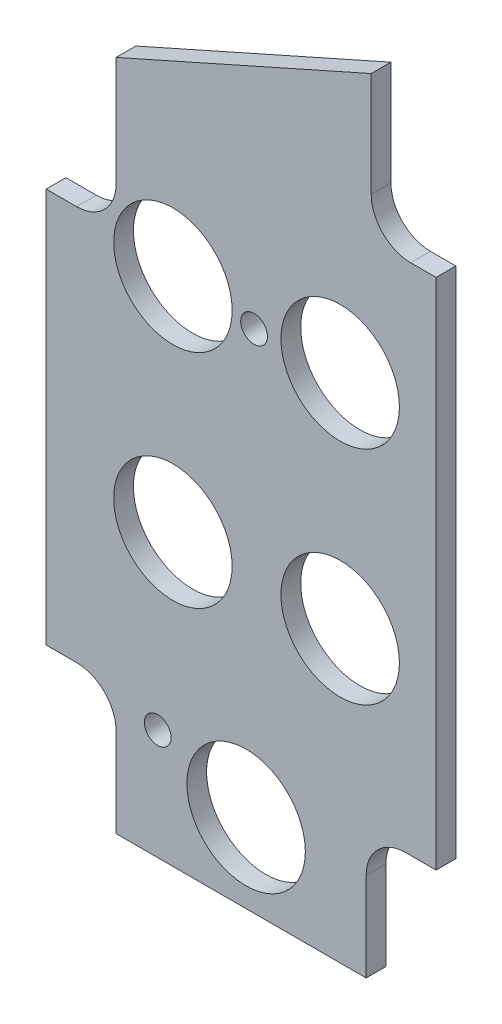
ISO-10303-21;
HEADER;
FILE_DESCRIPTION(('STEP AP214'),'2;1');
FILE_NAME('part.step','',(''),(''),'','','');
FILE_SCHEMA(('AUTOMOTIVE_DESIGN { 1 0 10303 214 1 1 1 1 }'));
ENDSEC;
DATA;
#1=APPLICATION_CONTEXT('core data for automotive mechanical design processes');
#2=APPLICATION_PROTOCOL_DEFINITION('international standard','automotive_design',2000,#1);
#3=PRODUCT_CONTEXT('',#1,'mechanical');
#4=PRODUCT('Part','Part','',(#3));
#5=PRODUCT_RELATED_PRODUCT_CATEGORY('part','',(#4));
#6=PRODUCT_DEFINITION_FORMATION('','',#4);
#7=PRODUCT_DEFINITION_CONTEXT('part definition',#1,'design');
#8=PRODUCT_DEFINITION('design','',#6,#7);
#9=PRODUCT_DEFINITION_SHAPE('','',#8);
#10=(LENGTH_UNIT() NAMED_UNIT(*) SI_UNIT(.MILLI.,.METRE.));
#11=(NAMED_UNIT(*) PLANE_ANGLE_UNIT() SI_UNIT($,.RADIAN.));
#12=(NAMED_UNIT(*) SI_UNIT($,.STERADIAN.) SOLID_ANGLE_UNIT());
#13=UNCERTAINTY_MEASURE_WITH_UNIT(LENGTH_MEASURE(1.E-05),#10,'distance_accuracy_value','');
#14=(GEOMETRIC_REPRESENTATION_CONTEXT(3) GLOBAL_UNCERTAINTY_ASSIGNED_CONTEXT((#13)) GLOBAL_UNIT_ASSIGNED_CONTEXT((#10,
#11,#12)) REPRESENTATION_CONTEXT('',''));
#15=CARTESIAN_POINT('',(0.,0.,0.));
#16=DIRECTION('',(0.,0.,1.));
#17=DIRECTION('',(1.,0.,0.));
#18=AXIS2_PLACEMENT_3D('',#15,#16,#17);
#19=CARTESIAN_POINT('',(62.6887935856796,131.,-3.175));
#20=DIRECTION('',(-0.406714772664201,0.913555194663523,0.));
#21=DIRECTION('',(-0.913555194663523,-0.406714772664201,0.));
#22=AXIS2_PLACEMENT_3D('',#19,#20,#21);
#23=PLANE('',#22);
#24=DIRECTION('',(0.,0.,1.));
#25=VECTOR('',#24,1.);
#26=CARTESIAN_POINT('',(11.2395,108.094774495655,-3.175));
#27=LINE('',#26,#25);
#28=CARTESIAN_POINT('',(11.2395,108.094774495655,-3.175));
#29=VERTEX_POINT('',#28);
#30=CARTESIAN_POINT('',(11.2395,108.094774495655,0.));
#31=VERTEX_POINT('',#30);
#32=EDGE_CURVE('E244',#29,#31,#27,.T.);
#33=ORIENTED_EDGE('',*,*,#32,.T.);
#34=DIRECTION('',(-0.913555194663523,-0.406714772664201,0.));
#35=VECTOR('',#34,1.);
#36=CARTESIAN_POINT('',(62.6887935856796,131.,0.));
#37=LINE('',#36,#35);
#38=CARTESIAN_POINT('',(52.2605,126.357323695655,0.));
#39=VERTEX_POINT('',#38);
#40=EDGE_CURVE('E173',#39,#31,#37,.T.);
#41=ORIENTED_EDGE('',*,*,#40,.F.);
#42=DIRECTION('',(0.,0.,1.));
#43=VECTOR('',#42,1.);
#44=CARTESIAN_POINT('',(52.2605,126.357323695655,-3.175));
#45=LINE('',#44,#43);
#46=CARTESIAN_POINT('',(52.2605,126.357323695655,-3.175));
#47=VERTEX_POINT('',#46);
#48=EDGE_CURVE('E157',#47,#39,#45,.T.);
#49=ORIENTED_EDGE('',*,*,#48,.F.);
#50=DIRECTION('',(-0.913555194663523,-0.406714772664201,0.));
#51=VECTOR('',#50,1.);
#52=CARTESIAN_POINT('',(62.6887935856796,131.,-3.175));
#53=LINE('',#52,#51);
#54=EDGE_CURVE('E171',#47,#29,#53,.T.);
#55=ORIENTED_EDGE('',*,*,#54,.T.);
#56=EDGE_LOOP('',(#33,#41,#49,#55));
#57=FACE_BOUND('',#56,.T.);
#58=ADVANCED_FACE('F39',(#57),#23,.T.);
#59=CARTESIAN_POINT('',(62.6887935856796,0.,-3.175));
#60=DIRECTION('',(1.,0.,0.));
#61=DIRECTION('',(0.,0.,-1.));
#62=AXIS2_PLACEMENT_3D('',#59,#60,#61);
#63=PLANE('',#62);
#64=DIRECTION('',(0.,0.,1.));
#65=VECTOR('',#64,1.);
#66=CARTESIAN_POINT('',(62.6887935856796,20.64,-3.175));
#67=LINE('',#66,#65);
#68=CARTESIAN_POINT('',(62.6887935856796,20.64,-3.175));
#69=VERTEX_POINT('',#68);
#70=CARTESIAN_POINT('',(62.6887935856796,20.64,0.));
#71=VERTEX_POINT('',#70);
#72=EDGE_CURVE('E251',#69,#71,#67,.T.);
#73=ORIENTED_EDGE('',*,*,#72,.F.);
#74=DIRECTION('',(0.,1.,0.));
#75=VECTOR('',#74,1.);
#76=CARTESIAN_POINT('',(62.6887935856796,0.,-3.175));
#77=LINE('',#76,#75);
#78=CARTESIAN_POINT('',(62.6887935856796,103.1875,-3.175));
#79=VERTEX_POINT('',#78);
#80=EDGE_CURVE('E11',#69,#79,#77,.T.);
#81=ORIENTED_EDGE('',*,*,#80,.T.);
#82=DIRECTION('',(0.,0.,1.));
#83=VECTOR('',#82,1.);
#84=CARTESIAN_POINT('',(62.6887935856796,103.1875,-3.175));
#85=LINE('',#84,#83);
#86=CARTESIAN_POINT('',(62.6887935856796,103.1875,0.));
#87=VERTEX_POINT('',#86);
#88=EDGE_CURVE('E224',#79,#87,#85,.T.);
#89=ORIENTED_EDGE('',*,*,#88,.T.);
#90=DIRECTION('',(0.,1.,0.));
#91=VECTOR('',#90,1.);
#92=CARTESIAN_POINT('',(62.6887935856796,0.,0.));
#93=LINE('',#92,#91);
#94=EDGE_CURVE('E183',#71,#87,#93,.T.);
#95=ORIENTED_EDGE('',*,*,#94,.F.);
#96=EDGE_LOOP('',(#73,#81,#89,#95));
#97=FACE_BOUND('',#96,.T.);
#98=ADVANCED_FACE('F349',(#97),#63,.T.);
#99=CARTESIAN_POINT('',(0.,0.,-3.175));
#100=DIRECTION('',(0.,-1.,0.));
#101=DIRECTION('',(0.,0.,-1.));
#102=AXIS2_PLACEMENT_3D('',#99,#100,#101);
#103=PLANE('',#102);
#104=DIRECTION('',(0.,0.,1.));
#105=VECTOR('',#104,1.);
#106=CARTESIAN_POINT('',(51.4487935856797,0.,-3.175));
#107=LINE('',#106,#105);
#108=CARTESIAN_POINT('',(51.4487935856797,0.,-3.175));
#109=VERTEX_POINT('',#108);
#110=CARTESIAN_POINT('',(51.4487935856797,0.,0.));
#111=VERTEX_POINT('',#110);
#112=EDGE_CURVE('E253',#109,#111,#107,.T.);
#113=ORIENTED_EDGE('',*,*,#112,.T.);
#114=DIRECTION('',(1.,0.,0.));
#115=VECTOR('',#114,1.);
#116=CARTESIAN_POINT('',(0.,0.,0.));
#117=LINE('',#116,#115);
#118=CARTESIAN_POINT('',(11.24,0.,0.));
#119=VERTEX_POINT('',#118);
#120=EDGE_CURVE('E188',#119,#111,#117,.T.);
#121=ORIENTED_EDGE('',*,*,#120,.F.);
#122=DIRECTION('',(0.,0.,1.));
#123=VECTOR('',#122,1.);
#124=CARTESIAN_POINT('',(11.24,0.,-3.175));
#125=LINE('',#124,#123);
#126=CARTESIAN_POINT('',(11.24,0.,-3.175));
#127=VERTEX_POINT('',#126);
#128=EDGE_CURVE('E63',#127,#119,#125,.T.);
#129=ORIENTED_EDGE('',*,*,#128,.F.);
#130=DIRECTION('',(1.,0.,0.));
#131=VECTOR('',#130,1.);
#132=CARTESIAN_POINT('',(0.,0.,-3.175));
#133=LINE('',#132,#131);
#134=EDGE_CURVE('E47',#127,#109,#133,.T.);
#135=ORIENTED_EDGE('',*,*,#134,.T.);
#136=EDGE_LOOP('',(#113,#121,#129,#135));
#137=FACE_BOUND('',#136,.T.);
#138=ADVANCED_FACE('F353',(#137),#103,.T.);
#139=CARTESIAN_POINT('',(0.,103.090949095655,-3.175));
#140=DIRECTION('',(-1.,0.,0.));
#141=DIRECTION('',(0.,-1.,0.));
#142=AXIS2_PLACEMENT_3D('',#139,#140,#141);
#143=PLANE('',#142);
#144=DIRECTION('',(0.,0.,1.));
#145=VECTOR('',#144,1.);
#146=CARTESIAN_POINT('',(0.,84.1375,-3.175));
#147=LINE('',#146,#145);
#148=CARTESIAN_POINT('',(0.,84.1375,-3.175));
#149=VERTEX_POINT('',#148);
#150=CARTESIAN_POINT('',(0.,84.1375,0.));
#151=VERTEX_POINT('',#150);
#152=EDGE_CURVE('E264',#149,#151,#147,.T.);
#153=ORIENTED_EDGE('',*,*,#152,.F.);
#154=DIRECTION('',(0.,-1.,0.));
#155=VECTOR('',#154,1.);
#156=CARTESIAN_POINT('',(0.,103.090949095655,-3.175));
#157=LINE('',#156,#155);
#158=CARTESIAN_POINT('',(0.,20.64,-3.175));
#159=VERTEX_POINT('',#158);
#160=EDGE_CURVE('E182',#149,#159,#157,.T.);
#161=ORIENTED_EDGE('',*,*,#160,.T.);
#162=DIRECTION('',(0.,0.,1.));
#163=VECTOR('',#162,1.);
#164=CARTESIAN_POINT('',(0.,20.64,-3.175));
#165=LINE('',#164,#163);
#166=CARTESIAN_POINT('',(0.,20.64,0.));
#167=VERTEX_POINT('',#166);
#168=EDGE_CURVE('E292',#159,#167,#165,.T.);
#169=ORIENTED_EDGE('',*,*,#168,.T.);
#170=DIRECTION('',(0.,-1.,0.));
#171=VECTOR('',#170,1.);
#172=CARTESIAN_POINT('',(0.,103.090949095655,0.));
#173=LINE('',#172,#171);
#174=EDGE_CURVE('E197',#151,#167,#173,.T.);
#175=ORIENTED_EDGE('',*,*,#174,.F.);
#176=EDGE_LOOP('',(#153,#161,#169,#175));
#177=FACE_BOUND('',#176,.T.);
#178=ADVANCED_FACE('F342',(#177),#143,.T.);
#179=CARTESIAN_POINT('',(0.,0.,-3.175));
#180=DIRECTION('',(0.,0.,1.));
#181=DIRECTION('',(1.,0.,0.));
#182=AXIS2_PLACEMENT_3D('',#179,#180,#181);
#183=PLANE('',#182);
#184=CARTESIAN_POINT('',(33.4263356539699,81.3833913233975,-3.175));
#185=DIRECTION('',(0.,0.,1.));
#186=DIRECTION('',(1.,0.,0.));
#187=AXIS2_PLACEMENT_3D('',#184,#185,#186);
#188=CIRCLE('',#187,2.15264999999999);
#189=CARTESIAN_POINT('',(35.5789856539699,81.3833913233975,-3.175));
#190=VERTEX_POINT('',#189);
#191=EDGE_CURVE('E215',#190,#190,#188,.T.);
#192=ORIENTED_EDGE('',*,*,#191,.T.);
#193=EDGE_LOOP('',(#192));
#194=FACE_BOUND('',#193,.T.);
#195=CARTESIAN_POINT('',(17.9313083732309,17.7712279582032,-3.175));
#196=DIRECTION('',(0.,0.,1.));
#197=DIRECTION('',(1.,0.,0.));
#198=AXIS2_PLACEMENT_3D('',#195,#196,#197);
#199=CIRCLE('',#198,2.15265);
#200=CARTESIAN_POINT('',(20.0839583732309,17.7712279582032,-3.175));
#201=VERTEX_POINT('',#200);
#202=EDGE_CURVE('E205',#201,#201,#199,.T.);
#203=ORIENTED_EDGE('',*,*,#202,.T.);
#204=EDGE_LOOP('',(#203));
#205=FACE_BOUND('',#204,.T.);
#206=CARTESIAN_POINT('',(20.3732350591324,46.5480061512906,-3.175));
#207=DIRECTION('',(0.,0.,1.));
#208=DIRECTION('',(1.,0.,0.));
#209=AXIS2_PLACEMENT_3D('',#206,#207,#208);
#210=CIRCLE('',#209,9.525);
#211=CARTESIAN_POINT('',(29.8982350591324,46.5480061512906,-3.175));
#212=VERTEX_POINT('',#211);
#213=EDGE_CURVE('E301',#212,#212,#210,.T.);
#214=ORIENTED_EDGE('',*,*,#213,.T.);
#215=EDGE_LOOP('',(#214));
#216=FACE_BOUND('',#215,.T.);
#217=CARTESIAN_POINT('',(20.3732350591324,82.1854238503903,-3.175));
#218=DIRECTION('',(0.,0.,1.));
#219=DIRECTION('',(1.,0.,0.));
#220=AXIS2_PLACEMENT_3D('',#217,#218,#219);
#221=CIRCLE('',#220,9.52500000000001);
#222=CARTESIAN_POINT('',(29.8982350591324,82.1854238503903,-3.175));
#223=VERTEX_POINT('',#222);
#224=EDGE_CURVE('E307',#223,#223,#221,.T.);
#225=ORIENTED_EDGE('',*,*,#224,.T.);
#226=EDGE_LOOP('',(#225));
#227=FACE_BOUND('',#226,.T.);
#228=CARTESIAN_POINT('',(47.2704904270103,82.1854238503903,-3.175));
#229=DIRECTION('',(0.,0.,1.));
#230=DIRECTION('',(1.,0.,0.));
#231=AXIS2_PLACEMENT_3D('',#228,#229,#230);
#232=CIRCLE('',#231,9.525);
#233=CARTESIAN_POINT('',(56.7954904270103,82.1854238503903,-3.175));
#234=VERTEX_POINT('',#233);
#235=EDGE_CURVE('E313',#234,#234,#232,.T.);
#236=ORIENTED_EDGE('',*,*,#235,.T.);
#237=EDGE_LOOP('',(#236));
#238=FACE_BOUND('',#237,.T.);
#239=CARTESIAN_POINT('',(47.2704904270103,46.5480061512906,-3.175));
#240=DIRECTION('',(0.,0.,1.));
#241=DIRECTION('',(1.,0.,0.));
#242=AXIS2_PLACEMENT_3D('',#239,#240,#241);
#243=CIRCLE('',#242,9.525);
#244=CARTESIAN_POINT('',(56.7954904270103,46.5480061512906,-3.175));
#245=VERTEX_POINT('',#244);
#246=EDGE_CURVE('E319',#245,#245,#243,.T.);
#247=ORIENTED_EDGE('',*,*,#246,.T.);
#248=EDGE_LOOP('',(#247));
#249=FACE_BOUND('',#248,.T.);
#250=CARTESIAN_POINT('',(32.1439076412773,12.7,-3.175));
#251=DIRECTION('',(0.,0.,1.));
#252=DIRECTION('',(1.,0.,0.));
#253=AXIS2_PLACEMENT_3D('',#250,#251,#252);
#254=CIRCLE('',#253,9.525);
#255=CARTESIAN_POINT('',(41.6689076412773,12.7,-3.175));
#256=VERTEX_POINT('',#255);
#257=EDGE_CURVE('E198',#256,#256,#254,.T.);
#258=ORIENTED_EDGE('',*,*,#257,.T.);
#259=EDGE_LOOP('',(#258));
#260=FACE_BOUND('',#259,.T.);
#261=ORIENTED_EDGE('',*,*,#80,.F.);
#262=DIRECTION('',(-1.,0.,0.));
#263=VECTOR('',#262,1.);
#264=CARTESIAN_POINT('',(62.6887935856796,20.64,-3.175));
#265=LINE('',#264,#263);
#266=CARTESIAN_POINT('',(57.7987935856796,20.64,-3.175));
#267=VERTEX_POINT('',#266);
#268=EDGE_CURVE('E238',#69,#267,#265,.T.);
#269=ORIENTED_EDGE('',*,*,#268,.T.);
#270=CARTESIAN_POINT('',(57.7987935856796,14.29,-3.175));
#271=DIRECTION('',(0.,0.,1.));
#272=DIRECTION('',(1.,0.,0.));
#273=AXIS2_PLACEMENT_3D('',#270,#271,#272);
#274=CIRCLE('',#273,6.35);
#275=CARTESIAN_POINT('',(51.4487935856797,14.29,-3.175));
#276=VERTEX_POINT('',#275);
#277=EDGE_CURVE('E231',#267,#276,#274,.T.);
#278=ORIENTED_EDGE('',*,*,#277,.T.);
#279=DIRECTION('',(0.,-1.,0.));
#280=VECTOR('',#279,1.);
#281=CARTESIAN_POINT('',(51.4487935856797,14.29,-3.175));
#282=LINE('',#281,#280);
#283=EDGE_CURVE('E234',#276,#109,#282,.T.);
#284=ORIENTED_EDGE('',*,*,#283,.T.);
#285=ORIENTED_EDGE('',*,*,#134,.F.);
#286=DIRECTION('',(0.,1.,0.));
#287=VECTOR('',#286,1.);
#288=CARTESIAN_POINT('',(11.24,14.29,-3.175));
#289=LINE('',#288,#287);
#290=CARTESIAN_POINT('',(11.24,14.29,-3.175));
#291=VERTEX_POINT('',#290);
#292=EDGE_CURVE('E277',#127,#291,#289,.T.);
#293=ORIENTED_EDGE('',*,*,#292,.T.);
#294=CARTESIAN_POINT('',(4.89,14.29,-3.175));
#295=DIRECTION('',(0.,0.,1.));
#296=DIRECTION('',(-1.,0.,0.));
#297=AXIS2_PLACEMENT_3D('',#294,#295,#296);
#298=CIRCLE('',#297,6.35);
#299=CARTESIAN_POINT('',(4.88999999999996,20.64,-3.175));
#300=VERTEX_POINT('',#299);
#301=EDGE_CURVE('E280',#291,#300,#298,.T.);
#302=ORIENTED_EDGE('',*,*,#301,.T.);
#303=DIRECTION('',(-1.,0.,0.));
#304=VECTOR('',#303,1.);
#305=CARTESIAN_POINT('',(0.,20.64,-3.175));
#306=LINE('',#305,#304);
#307=EDGE_CURVE('E284',#300,#159,#306,.T.);
#308=ORIENTED_EDGE('',*,*,#307,.T.);
#309=ORIENTED_EDGE('',*,*,#160,.F.);
#310=DIRECTION('',(1.,0.,0.));
#311=VECTOR('',#310,1.);
#312=CARTESIAN_POINT('',(0.,84.1375,-3.175));
#313=LINE('',#312,#311);
#314=CARTESIAN_POINT('',(4.8895,84.1375,-3.175));
#315=VERTEX_POINT('',#314);
#316=EDGE_CURVE('E257',#149,#315,#313,.T.);
#317=ORIENTED_EDGE('',*,*,#316,.T.);
#318=CARTESIAN_POINT('',(4.8895,90.4875,-3.175));
#319=DIRECTION('',(0.,0.,1.));
#320=DIRECTION('',(1.,0.,0.));
#321=AXIS2_PLACEMENT_3D('',#318,#319,#320);
#322=CIRCLE('',#321,6.35);
#323=CARTESIAN_POINT('',(11.2395,90.4875,-3.175));
#324=VERTEX_POINT('',#323);
#325=EDGE_CURVE('E260',#315,#324,#322,.T.);
#326=ORIENTED_EDGE('',*,*,#325,.T.);
#327=DIRECTION('',(0.,1.,0.));
#328=VECTOR('',#327,1.);
#329=CARTESIAN_POINT('',(11.2395,90.4875,-3.175));
#330=LINE('',#329,#328);
#331=EDGE_CURVE('E181',#324,#29,#330,.T.);
#332=ORIENTED_EDGE('',*,*,#331,.T.);
#333=ORIENTED_EDGE('',*,*,#54,.F.);
#334=DIRECTION('',(0.,-1.,0.));
#335=VECTOR('',#334,1.);
#336=CARTESIAN_POINT('',(52.2605,109.5375,-3.175));
#337=LINE('',#336,#335);
#338=CARTESIAN_POINT('',(52.2605,109.5375,-3.175));
#339=VERTEX_POINT('',#338);
#340=EDGE_CURVE('E153',#47,#339,#337,.T.);
#341=ORIENTED_EDGE('',*,*,#340,.T.);
#342=CARTESIAN_POINT('',(58.6105,109.5375,-3.175));
#343=DIRECTION('',(0.,0.,1.));
#344=DIRECTION('',(-1.,0.,0.));
#345=AXIS2_PLACEMENT_3D('',#342,#343,#344);
#346=CIRCLE('',#345,6.35);
#347=CARTESIAN_POINT('',(58.6105,103.1875,-3.175));
#348=VERTEX_POINT('',#347);
#349=EDGE_CURVE('E164',#339,#348,#346,.T.);
#350=ORIENTED_EDGE('',*,*,#349,.T.);
#351=DIRECTION('',(1.,0.,0.));
#352=VECTOR('',#351,1.);
#353=CARTESIAN_POINT('',(62.6887935856796,103.1875,-3.175));
#354=LINE('',#353,#352);
#355=EDGE_CURVE('E174',#348,#79,#354,.T.);
#356=ORIENTED_EDGE('',*,*,#355,.T.);
#357=EDGE_LOOP('',(#261,#269,#278,#284,#285,#293,#302,#308,#309,#317,#326,#332,#333,#341,#350,#356));
#358=FACE_BOUND('',#357,.T.);
#359=ADVANCED_FACE('F178',(#194,#205,#216,#227,#238,#249,#260,#358),#183,.F.);
#360=CARTESIAN_POINT('',(0.,0.,0.));
#361=DIRECTION('',(0.,0.,1.));
#362=DIRECTION('',(1.,0.,0.));
#363=AXIS2_PLACEMENT_3D('',#360,#361,#362);
#364=PLANE('',#363);
#365=CARTESIAN_POINT('',(33.4263356539699,81.3833913233975,0.));
#366=DIRECTION('',(0.,0.,1.));
#367=DIRECTION('',(1.,0.,0.));
#368=AXIS2_PLACEMENT_3D('',#365,#366,#367);
#369=CIRCLE('',#368,2.15264999999999);
#370=CARTESIAN_POINT('',(35.5789856539699,81.3833913233975,0.));
#371=VERTEX_POINT('',#370);
#372=EDGE_CURVE('E42',#371,#371,#369,.T.);
#373=ORIENTED_EDGE('',*,*,#372,.F.);
#374=EDGE_LOOP('',(#373));
#375=FACE_BOUND('',#374,.T.);
#376=CARTESIAN_POINT('',(17.9313083732309,17.7712279582032,0.));
#377=DIRECTION('',(0.,0.,1.));
#378=DIRECTION('',(1.,0.,0.));
#379=AXIS2_PLACEMENT_3D('',#376,#377,#378);
#380=CIRCLE('',#379,2.15264999999999);
#381=CARTESIAN_POINT('',(20.0839583732309,17.7712279582032,0.));
#382=VERTEX_POINT('',#381);
#383=EDGE_CURVE('E202',#382,#382,#380,.T.);
#384=ORIENTED_EDGE('',*,*,#383,.F.);
#385=EDGE_LOOP('',(#384));
#386=FACE_BOUND('',#385,.T.);
#387=DIRECTION('',(-1.,0.,0.));
#388=VECTOR('',#387,1.);
#389=CARTESIAN_POINT('',(62.6887935856796,20.64,0.));
#390=LINE('',#389,#388);
#391=CARTESIAN_POINT('',(57.7987935856796,20.64,0.));
#392=VERTEX_POINT('',#391);
#393=EDGE_CURVE('E235',#71,#392,#390,.T.);
#394=ORIENTED_EDGE('',*,*,#393,.F.);
#395=ORIENTED_EDGE('',*,*,#94,.T.);
#396=DIRECTION('',(1.,0.,0.));
#397=VECTOR('',#396,1.);
#398=CARTESIAN_POINT('',(62.6887935856796,103.1875,0.));
#399=LINE('',#398,#397);
#400=CARTESIAN_POINT('',(58.6105,103.1875,0.));
#401=VERTEX_POINT('',#400);
#402=EDGE_CURVE('E165',#401,#87,#399,.T.);
#403=ORIENTED_EDGE('',*,*,#402,.F.);
#404=CARTESIAN_POINT('',(58.6105,109.5375,0.));
#405=DIRECTION('',(0.,0.,1.));
#406=DIRECTION('',(-1.,0.,0.));
#407=AXIS2_PLACEMENT_3D('',#404,#405,#406);
#408=CIRCLE('',#407,6.35);
#409=CARTESIAN_POINT('',(52.2605,109.5375,0.));
#410=VERTEX_POINT('',#409);
#411=EDGE_CURVE('E208',#410,#401,#408,.T.);
#412=ORIENTED_EDGE('',*,*,#411,.F.);
#413=DIRECTION('',(0.,-1.,0.));
#414=VECTOR('',#413,1.);
#415=CARTESIAN_POINT('',(52.2605,109.5375,0.));
#416=LINE('',#415,#414);
#417=EDGE_CURVE('E204',#39,#410,#416,.T.);
#418=ORIENTED_EDGE('',*,*,#417,.F.);
#419=ORIENTED_EDGE('',*,*,#40,.T.);
#420=DIRECTION('',(0.,1.,0.));
#421=VECTOR('',#420,1.);
#422=CARTESIAN_POINT('',(11.2395,90.4875,0.));
#423=LINE('',#422,#421);
#424=CARTESIAN_POINT('',(11.2395,90.4875,0.));
#425=VERTEX_POINT('',#424);
#426=EDGE_CURVE('E261',#425,#31,#423,.T.);
#427=ORIENTED_EDGE('',*,*,#426,.F.);
#428=CARTESIAN_POINT('',(4.8895,90.4875,0.));
#429=DIRECTION('',(0.,0.,1.));
#430=DIRECTION('',(1.,0.,0.));
#431=AXIS2_PLACEMENT_3D('',#428,#429,#430);
#432=CIRCLE('',#431,6.35);
#433=CARTESIAN_POINT('',(4.8895,84.1375,0.));
#434=VERTEX_POINT('',#433);
#435=EDGE_CURVE('E267',#434,#425,#432,.T.);
#436=ORIENTED_EDGE('',*,*,#435,.F.);
#437=DIRECTION('',(1.,0.,0.));
#438=VECTOR('',#437,1.);
#439=CARTESIAN_POINT('',(0.,84.1375,0.));
#440=LINE('',#439,#438);
#441=EDGE_CURVE('E227',#151,#434,#440,.T.);
#442=ORIENTED_EDGE('',*,*,#441,.F.);
#443=ORIENTED_EDGE('',*,*,#174,.T.);
#444=DIRECTION('',(-1.,0.,0.));
#445=VECTOR('',#444,1.);
#446=CARTESIAN_POINT('',(0.,20.64,0.));
#447=LINE('',#446,#445);
#448=CARTESIAN_POINT('',(4.88999999999996,20.64,0.));
#449=VERTEX_POINT('',#448);
#450=EDGE_CURVE('E281',#449,#167,#447,.T.);
#451=ORIENTED_EDGE('',*,*,#450,.F.);
#452=CARTESIAN_POINT('',(4.89,14.29,0.));
#453=DIRECTION('',(0.,0.,1.));
#454=DIRECTION('',(-1.,0.,0.));
#455=AXIS2_PLACEMENT_3D('',#452,#453,#454);
#456=CIRCLE('',#455,6.35);
#457=CARTESIAN_POINT('',(11.24,14.29,0.));
#458=VERTEX_POINT('',#457);
#459=EDGE_CURVE('E288',#458,#449,#456,.T.);
#460=ORIENTED_EDGE('',*,*,#459,.F.);
#461=DIRECTION('',(0.,1.,0.));
#462=VECTOR('',#461,1.);
#463=CARTESIAN_POINT('',(11.24,14.29,0.));
#464=LINE('',#463,#462);
#465=EDGE_CURVE('E250',#119,#458,#464,.T.);
#466=ORIENTED_EDGE('',*,*,#465,.F.);
#467=ORIENTED_EDGE('',*,*,#120,.T.);
#468=DIRECTION('',(0.,-1.,0.));
#469=VECTOR('',#468,1.);
#470=CARTESIAN_POINT('',(51.4487935856797,14.29,0.));
#471=LINE('',#470,#469);
#472=CARTESIAN_POINT('',(51.4487935856797,14.29,0.));
#473=VERTEX_POINT('',#472);
#474=EDGE_CURVE('E243',#473,#111,#471,.T.);
#475=ORIENTED_EDGE('',*,*,#474,.F.);
#476=CARTESIAN_POINT('',(57.7987935856796,14.29,0.));
#477=DIRECTION('',(0.,0.,1.));
#478=DIRECTION('',(1.,0.,0.));
#479=AXIS2_PLACEMENT_3D('',#476,#477,#478);
#480=CIRCLE('',#479,6.35);
#481=EDGE_CURVE('E55',#392,#473,#480,.T.);
#482=ORIENTED_EDGE('',*,*,#481,.F.);
#483=EDGE_LOOP('',(#394,#395,#403,#412,#418,#419,#427,#436,#442,#443,#451,#460,#466,#467,#475,#482));
#484=FACE_BOUND('',#483,.T.);
#485=CARTESIAN_POINT('',(20.3732350591324,46.5480061512906,0.));
#486=DIRECTION('',(0.,0.,1.));
#487=DIRECTION('',(1.,0.,0.));
#488=AXIS2_PLACEMENT_3D('',#485,#486,#487);
#489=CIRCLE('',#488,9.525);
#490=CARTESIAN_POINT('',(29.8982350591324,46.5480061512906,0.));
#491=VERTEX_POINT('',#490);
#492=EDGE_CURVE('E295',#491,#491,#489,.T.);
#493=ORIENTED_EDGE('',*,*,#492,.F.);
#494=EDGE_LOOP('',(#493));
#495=FACE_BOUND('',#494,.T.);
#496=CARTESIAN_POINT('',(20.3732350591324,82.1854238503903,0.));
#497=DIRECTION('',(0.,0.,1.));
#498=DIRECTION('',(1.,0.,0.));
#499=AXIS2_PLACEMENT_3D('',#496,#497,#498);
#500=CIRCLE('',#499,9.52500000000001);
#501=CARTESIAN_POINT('',(29.8982350591324,82.1854238503903,0.));
#502=VERTEX_POINT('',#501);
#503=EDGE_CURVE('E304',#502,#502,#500,.T.);
#504=ORIENTED_EDGE('',*,*,#503,.F.);
#505=EDGE_LOOP('',(#504));
#506=FACE_BOUND('',#505,.T.);
#507=CARTESIAN_POINT('',(47.2704904270103,82.1854238503903,0.));
#508=DIRECTION('',(0.,0.,1.));
#509=DIRECTION('',(1.,0.,0.));
#510=AXIS2_PLACEMENT_3D('',#507,#508,#509);
#511=CIRCLE('',#510,9.525);
#512=CARTESIAN_POINT('',(56.7954904270103,82.1854238503903,0.));
#513=VERTEX_POINT('',#512);
#514=EDGE_CURVE('E310',#513,#513,#511,.T.);
#515=ORIENTED_EDGE('',*,*,#514,.F.);
#516=EDGE_LOOP('',(#515));
#517=FACE_BOUND('',#516,.T.);
#518=CARTESIAN_POINT('',(47.2704904270103,46.5480061512906,0.));
#519=DIRECTION('',(0.,0.,1.));
#520=DIRECTION('',(1.,0.,0.));
#521=AXIS2_PLACEMENT_3D('',#518,#519,#520);
#522=CIRCLE('',#521,9.525);
#523=CARTESIAN_POINT('',(56.7954904270103,46.5480061512906,0.));
#524=VERTEX_POINT('',#523);
#525=EDGE_CURVE('E316',#524,#524,#522,.T.);
#526=ORIENTED_EDGE('',*,*,#525,.F.);
#527=EDGE_LOOP('',(#526));
#528=FACE_BOUND('',#527,.T.);
#529=CARTESIAN_POINT('',(32.1439076412773,12.7,0.));
#530=DIRECTION('',(0.,0.,1.));
#531=DIRECTION('',(1.,0.,0.));
#532=AXIS2_PLACEMENT_3D('',#529,#530,#531);
#533=CIRCLE('',#532,9.525);
#534=CARTESIAN_POINT('',(41.6689076412773,12.7,0.));
#535=VERTEX_POINT('',#534);
#536=EDGE_CURVE('E191',#535,#535,#533,.T.);
#537=ORIENTED_EDGE('',*,*,#536,.F.);
#538=EDGE_LOOP('',(#537));
#539=FACE_BOUND('',#538,.T.);
#540=ADVANCED_FACE('F331',(#375,#386,#484,#495,#506,#517,#528,#539),#364,.T.);
#541=CARTESIAN_POINT('',(32.1439076412773,12.7,-3.175));
#542=DIRECTION('',(0.,0.,1.));
#543=DIRECTION('',(1.,0.,0.));
#544=AXIS2_PLACEMENT_3D('',#541,#542,#543);
#545=CYLINDRICAL_SURFACE('',#544,9.525);
#546=ORIENTED_EDGE('',*,*,#257,.F.);
#547=EDGE_LOOP('',(#546));
#548=FACE_BOUND('',#547,.T.);
#549=ORIENTED_EDGE('',*,*,#536,.T.);
#550=EDGE_LOOP('',(#549));
#551=FACE_BOUND('',#550,.T.);
#552=ADVANCED_FACE('F329',(#548,#551),#545,.F.);
#553=CARTESIAN_POINT('',(47.2704904270103,46.5480061512906,-3.175));
#554=DIRECTION('',(0.,0.,1.));
#555=DIRECTION('',(1.,0.,0.));
#556=AXIS2_PLACEMENT_3D('',#553,#554,#555);
#557=CYLINDRICAL_SURFACE('',#556,9.525);
#558=ORIENTED_EDGE('',*,*,#246,.F.);
#559=EDGE_LOOP('',(#558));
#560=FACE_BOUND('',#559,.T.);
#561=ORIENTED_EDGE('',*,*,#525,.T.);
#562=EDGE_LOOP('',(#561));
#563=FACE_BOUND('',#562,.T.);
#564=ADVANCED_FACE('F339',(#560,#563),#557,.F.);
#565=CARTESIAN_POINT('',(47.2704904270103,82.1854238503903,-3.175));
#566=DIRECTION('',(0.,0.,1.));
#567=DIRECTION('',(1.,0.,0.));
#568=AXIS2_PLACEMENT_3D('',#565,#566,#567);
#569=CYLINDRICAL_SURFACE('',#568,9.525);
#570=ORIENTED_EDGE('',*,*,#235,.F.);
#571=EDGE_LOOP('',(#570));
#572=FACE_BOUND('',#571,.T.);
#573=ORIENTED_EDGE('',*,*,#514,.T.);
#574=EDGE_LOOP('',(#573));
#575=FACE_BOUND('',#574,.T.);
#576=ADVANCED_FACE('F435',(#572,#575),#569,.F.);
#577=CARTESIAN_POINT('',(20.3732350591324,82.1854238503903,-3.175));
#578=DIRECTION('',(0.,0.,1.));
#579=DIRECTION('',(1.,0.,0.));
#580=AXIS2_PLACEMENT_3D('',#577,#578,#579);
#581=CYLINDRICAL_SURFACE('',#580,9.52500000000001);
#582=ORIENTED_EDGE('',*,*,#224,.F.);
#583=EDGE_LOOP('',(#582));
#584=FACE_BOUND('',#583,.T.);
#585=ORIENTED_EDGE('',*,*,#503,.T.);
#586=EDGE_LOOP('',(#585));
#587=FACE_BOUND('',#586,.T.);
#588=ADVANCED_FACE('F431',(#584,#587),#581,.F.);
#589=CARTESIAN_POINT('',(20.3732350591324,46.5480061512906,-3.175));
#590=DIRECTION('',(0.,0.,1.));
#591=DIRECTION('',(1.,0.,0.));
#592=AXIS2_PLACEMENT_3D('',#589,#590,#591);
#593=CYLINDRICAL_SURFACE('',#592,9.525);
#594=ORIENTED_EDGE('',*,*,#213,.F.);
#595=EDGE_LOOP('',(#594));
#596=FACE_BOUND('',#595,.T.);
#597=ORIENTED_EDGE('',*,*,#492,.T.);
#598=EDGE_LOOP('',(#597));
#599=FACE_BOUND('',#598,.T.);
#600=ADVANCED_FACE('F421',(#596,#599),#593,.F.);
#601=CARTESIAN_POINT('',(0.,20.64,-3.175));
#602=DIRECTION('',(0.,1.,0.));
#603=DIRECTION('',(0.,0.,1.));
#604=AXIS2_PLACEMENT_3D('',#601,#602,#603);
#605=PLANE('',#604);
#606=ORIENTED_EDGE('',*,*,#450,.T.);
#607=ORIENTED_EDGE('',*,*,#168,.F.);
#608=ORIENTED_EDGE('',*,*,#307,.F.);
#609=DIRECTION('',(0.,0.,1.));
#610=VECTOR('',#609,1.);
#611=CARTESIAN_POINT('',(4.88999999999996,20.64,-3.175));
#612=LINE('',#611,#610);
#613=EDGE_CURVE('E296',#300,#449,#612,.T.);
#614=ORIENTED_EDGE('',*,*,#613,.T.);
#615=EDGE_LOOP('',(#606,#607,#608,#614));
#616=FACE_BOUND('',#615,.T.);
#617=ADVANCED_FACE('F373',(#616),#605,.F.);
#618=CARTESIAN_POINT('',(4.89,14.29,-3.175));
#619=DIRECTION('',(0.,0.,1.));
#620=DIRECTION('',(1.,0.,0.));
#621=AXIS2_PLACEMENT_3D('',#618,#619,#620);
#622=CYLINDRICAL_SURFACE('',#621,6.35);
#623=ORIENTED_EDGE('',*,*,#459,.T.);
#624=ORIENTED_EDGE('',*,*,#613,.F.);
#625=ORIENTED_EDGE('',*,*,#301,.F.);
#626=DIRECTION('',(0.,0.,1.));
#627=VECTOR('',#626,1.);
#628=CARTESIAN_POINT('',(11.24,14.29,-3.175));
#629=LINE('',#628,#627);
#630=EDGE_CURVE('E298',#291,#458,#629,.T.);
#631=ORIENTED_EDGE('',*,*,#630,.T.);
#632=EDGE_LOOP('',(#623,#624,#625,#631));
#633=FACE_BOUND('',#632,.T.);
#634=ADVANCED_FACE('F420',(#633),#622,.F.);
#635=CARTESIAN_POINT('',(11.24,14.29,-3.175));
#636=DIRECTION('',(1.,0.,0.));
#637=DIRECTION('',(0.,0.,-1.));
#638=AXIS2_PLACEMENT_3D('',#635,#636,#637);
#639=PLANE('',#638);
#640=ORIENTED_EDGE('',*,*,#465,.T.);
#641=ORIENTED_EDGE('',*,*,#630,.F.);
#642=ORIENTED_EDGE('',*,*,#292,.F.);
#643=ORIENTED_EDGE('',*,*,#128,.T.);
#644=EDGE_LOOP('',(#640,#641,#642,#643));
#645=FACE_BOUND('',#644,.T.);
#646=ADVANCED_FACE('F424',(#645),#639,.F.);
#647=CARTESIAN_POINT('',(62.6887935856796,103.1875,-3.175));
#648=DIRECTION('',(0.,-1.,0.));
#649=DIRECTION('',(0.,0.,-1.));
#650=AXIS2_PLACEMENT_3D('',#647,#648,#649);
#651=PLANE('',#650);
#652=ORIENTED_EDGE('',*,*,#402,.T.);
#653=ORIENTED_EDGE('',*,*,#88,.F.);
#654=ORIENTED_EDGE('',*,*,#355,.F.);
#655=DIRECTION('',(0.,0.,1.));
#656=VECTOR('',#655,1.);
#657=CARTESIAN_POINT('',(58.6105,103.1875,-3.175));
#658=LINE('',#657,#656);
#659=EDGE_CURVE('E228',#348,#401,#658,.T.);
#660=ORIENTED_EDGE('',*,*,#659,.T.);
#661=EDGE_LOOP('',(#652,#653,#654,#660));
#662=FACE_BOUND('',#661,.T.);
#663=ADVANCED_FACE('F428',(#662),#651,.F.);
#664=CARTESIAN_POINT('',(58.6105,109.5375,-3.175));
#665=DIRECTION('',(0.,0.,1.));
#666=DIRECTION('',(1.,0.,0.));
#667=AXIS2_PLACEMENT_3D('',#664,#665,#666);
#668=CYLINDRICAL_SURFACE('',#667,6.35);
#669=ORIENTED_EDGE('',*,*,#411,.T.);
#670=ORIENTED_EDGE('',*,*,#659,.F.);
#671=ORIENTED_EDGE('',*,*,#349,.F.);
#672=DIRECTION('',(0.,0.,1.));
#673=VECTOR('',#672,1.);
#674=CARTESIAN_POINT('',(52.2605,109.5375,-3.175));
#675=LINE('',#674,#673);
#676=EDGE_CURVE('E159',#339,#410,#675,.T.);
#677=ORIENTED_EDGE('',*,*,#676,.T.);
#678=EDGE_LOOP('',(#669,#670,#671,#677));
#679=FACE_BOUND('',#678,.T.);
#680=ADVANCED_FACE('F390',(#679),#668,.F.);
#681=CARTESIAN_POINT('',(52.2605,109.5375,-3.175));
#682=DIRECTION('',(-1.,0.,0.));
#683=DIRECTION('',(0.,0.,1.));
#684=AXIS2_PLACEMENT_3D('',#681,#682,#683);
#685=PLANE('',#684);
#686=ORIENTED_EDGE('',*,*,#417,.T.);
#687=ORIENTED_EDGE('',*,*,#676,.F.);
#688=ORIENTED_EDGE('',*,*,#340,.F.);
#689=ORIENTED_EDGE('',*,*,#48,.T.);
#690=EDGE_LOOP('',(#686,#687,#688,#689));
#691=FACE_BOUND('',#690,.T.);
#692=ADVANCED_FACE('F156',(#691),#685,.F.);
#693=CARTESIAN_POINT('',(11.2395,90.4875,-3.175));
#694=DIRECTION('',(1.,0.,0.));
#695=DIRECTION('',(0.,1.,0.));
#696=AXIS2_PLACEMENT_3D('',#693,#694,#695);
#697=PLANE('',#696);
#698=ORIENTED_EDGE('',*,*,#426,.T.);
#699=ORIENTED_EDGE('',*,*,#32,.F.);
#700=ORIENTED_EDGE('',*,*,#331,.F.);
#701=DIRECTION('',(0.,0.,1.));
#702=VECTOR('',#701,1.);
#703=CARTESIAN_POINT('',(11.2395,90.4875,-3.175));
#704=LINE('',#703,#702);
#705=EDGE_CURVE('E272',#324,#425,#704,.T.);
#706=ORIENTED_EDGE('',*,*,#705,.T.);
#707=EDGE_LOOP('',(#698,#699,#700,#706));
#708=FACE_BOUND('',#707,.T.);
#709=ADVANCED_FACE('F386',(#708),#697,.F.);
#710=CARTESIAN_POINT('',(4.8895,90.4875,-3.175));
#711=DIRECTION('',(0.,0.,1.));
#712=DIRECTION('',(1.,0.,0.));
#713=AXIS2_PLACEMENT_3D('',#710,#711,#712);
#714=CYLINDRICAL_SURFACE('',#713,6.35);
#715=ORIENTED_EDGE('',*,*,#435,.T.);
#716=ORIENTED_EDGE('',*,*,#705,.F.);
#717=ORIENTED_EDGE('',*,*,#325,.F.);
#718=DIRECTION('',(0.,0.,1.));
#719=VECTOR('',#718,1.);
#720=CARTESIAN_POINT('',(4.8895,84.1375,-3.175));
#721=LINE('',#720,#719);
#722=EDGE_CURVE('E274',#315,#434,#721,.T.);
#723=ORIENTED_EDGE('',*,*,#722,.T.);
#724=EDGE_LOOP('',(#715,#716,#717,#723));
#725=FACE_BOUND('',#724,.T.);
#726=ADVANCED_FACE('F384',(#725),#714,.F.);
#727=CARTESIAN_POINT('',(0.,84.1375,-3.175));
#728=DIRECTION('',(0.,-1.,0.));
#729=DIRECTION('',(0.,0.,-1.));
#730=AXIS2_PLACEMENT_3D('',#727,#728,#729);
#731=PLANE('',#730);
#732=ORIENTED_EDGE('',*,*,#441,.T.);
#733=ORIENTED_EDGE('',*,*,#722,.F.);
#734=ORIENTED_EDGE('',*,*,#316,.F.);
#735=ORIENTED_EDGE('',*,*,#152,.T.);
#736=EDGE_LOOP('',(#732,#733,#734,#735));
#737=FACE_BOUND('',#736,.T.);
#738=ADVANCED_FACE('F381',(#737),#731,.F.);
#739=CARTESIAN_POINT('',(57.7987935856796,14.29,-3.175));
#740=DIRECTION('',(0.,0.,1.));
#741=DIRECTION('',(1.,0.,0.));
#742=AXIS2_PLACEMENT_3D('',#739,#740,#741);
#743=CYLINDRICAL_SURFACE('',#742,6.35);
#744=ORIENTED_EDGE('',*,*,#481,.T.);
#745=DIRECTION('',(0.,0.,1.));
#746=VECTOR('',#745,1.);
#747=CARTESIAN_POINT('',(51.4487935856797,14.29,-3.175));
#748=LINE('',#747,#746);
#749=EDGE_CURVE('E241',#276,#473,#748,.T.);
#750=ORIENTED_EDGE('',*,*,#749,.F.);
#751=ORIENTED_EDGE('',*,*,#277,.F.);
#752=DIRECTION('',(0.,0.,1.));
#753=VECTOR('',#752,1.);
#754=CARTESIAN_POINT('',(57.7987935856796,20.64,-3.175));
#755=LINE('',#754,#753);
#756=EDGE_CURVE('E248',#267,#392,#755,.T.);
#757=ORIENTED_EDGE('',*,*,#756,.T.);
#758=EDGE_LOOP('',(#744,#750,#751,#757));
#759=FACE_BOUND('',#758,.T.);
#760=ADVANCED_FACE('F403',(#759),#743,.F.);
#761=CARTESIAN_POINT('',(62.6887935856796,20.64,-3.175));
#762=DIRECTION('',(0.,1.,0.));
#763=DIRECTION('',(0.,0.,1.));
#764=AXIS2_PLACEMENT_3D('',#761,#762,#763);
#765=PLANE('',#764);
#766=ORIENTED_EDGE('',*,*,#393,.T.);
#767=ORIENTED_EDGE('',*,*,#756,.F.);
#768=ORIENTED_EDGE('',*,*,#268,.F.);
#769=ORIENTED_EDGE('',*,*,#72,.T.);
#770=EDGE_LOOP('',(#766,#767,#768,#769));
#771=FACE_BOUND('',#770,.T.);
#772=ADVANCED_FACE('F395',(#771),#765,.F.);
#773=CARTESIAN_POINT('',(51.4487935856797,14.29,-3.175));
#774=DIRECTION('',(-1.,0.,0.));
#775=DIRECTION('',(0.,0.,1.));
#776=AXIS2_PLACEMENT_3D('',#773,#774,#775);
#777=PLANE('',#776);
#778=ORIENTED_EDGE('',*,*,#474,.T.);
#779=ORIENTED_EDGE('',*,*,#112,.F.);
#780=ORIENTED_EDGE('',*,*,#283,.F.);
#781=ORIENTED_EDGE('',*,*,#749,.T.);
#782=EDGE_LOOP('',(#778,#779,#780,#781));
#783=FACE_BOUND('',#782,.T.);
#784=ADVANCED_FACE('F399',(#783),#777,.F.);
#785=CARTESIAN_POINT('',(17.9313083732309,17.7712279582032,3.175));
#786=DIRECTION('',(0.,0.,1.));
#787=DIRECTION('',(1.,0.,0.));
#788=AXIS2_PLACEMENT_3D('',#785,#786,#787);
#789=CYLINDRICAL_SURFACE('',#788,2.15264999999999);
#790=ORIENTED_EDGE('',*,*,#383,.T.);
#791=EDGE_LOOP('',(#790));
#792=FACE_BOUND('',#791,.T.);
#793=ORIENTED_EDGE('',*,*,#202,.F.);
#794=EDGE_LOOP('',(#793));
#795=FACE_BOUND('',#794,.T.);
#796=ADVANCED_FACE('F524',(#792,#795),#789,.F.);
#797=CARTESIAN_POINT('',(33.4263356539699,81.3833913233975,3.175));
#798=DIRECTION('',(0.,0.,1.));
#799=DIRECTION('',(1.,0.,0.));
#800=AXIS2_PLACEMENT_3D('',#797,#798,#799);
#801=CYLINDRICAL_SURFACE('',#800,2.15264999999999);
#802=ORIENTED_EDGE('',*,*,#372,.T.);
#803=EDGE_LOOP('',(#802));
#804=FACE_BOUND('',#803,.T.);
#805=ORIENTED_EDGE('',*,*,#191,.F.);
#806=EDGE_LOOP('',(#805));
#807=FACE_BOUND('',#806,.T.);
#808=ADVANCED_FACE('F544',(#804,#807),#801,.F.);
#809=CLOSED_SHELL('',(#58,#98,#138,#178,#359,#540,#552,#564,#576,#588,#600,#617,#634,#646,#663,
#680,#692,#709,#726,#738,#760,#772,#784,#796,#808));
#810=MANIFOLD_SOLID_BREP('B2',#809);
#811=ADVANCED_BREP_SHAPE_REPRESENTATION('',(#18,#810),#14);
#812=SHAPE_DEFINITION_REPRESENTATION(#9,#811);
ENDSEC;
END-ISO-10303-21;
